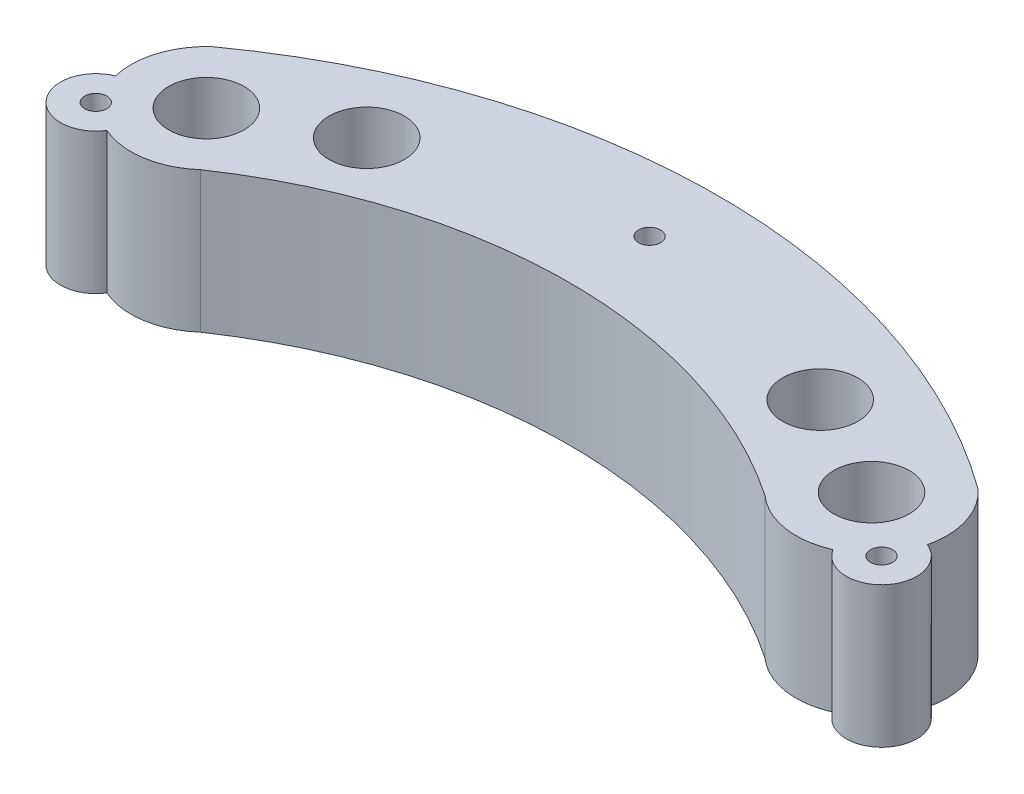
ISO-10303-21;
HEADER;
FILE_DESCRIPTION(('STEP AP214'),'2;1');
FILE_NAME('part.step','',(''),(''),'','','');
FILE_SCHEMA(('AUTOMOTIVE_DESIGN { 1 0 10303 214 1 1 1 1 }'));
ENDSEC;
DATA;
#1=APPLICATION_CONTEXT('core data for automotive mechanical design processes');
#2=APPLICATION_PROTOCOL_DEFINITION('international standard','automotive_design',2000,#1);
#3=PRODUCT_CONTEXT('',#1,'mechanical');
#4=PRODUCT('Part','Part','',(#3));
#5=PRODUCT_RELATED_PRODUCT_CATEGORY('part','',(#4));
#6=PRODUCT_DEFINITION_FORMATION('','',#4);
#7=PRODUCT_DEFINITION_CONTEXT('part definition',#1,'design');
#8=PRODUCT_DEFINITION('design','',#6,#7);
#9=PRODUCT_DEFINITION_SHAPE('','',#8);
#10=(LENGTH_UNIT() NAMED_UNIT(*) SI_UNIT(.MILLI.,.METRE.));
#11=(NAMED_UNIT(*) PLANE_ANGLE_UNIT() SI_UNIT($,.RADIAN.));
#12=(NAMED_UNIT(*) SI_UNIT($,.STERADIAN.) SOLID_ANGLE_UNIT());
#13=UNCERTAINTY_MEASURE_WITH_UNIT(LENGTH_MEASURE(1.E-05),#10,'distance_accuracy_value','');
#14=(GEOMETRIC_REPRESENTATION_CONTEXT(3) GLOBAL_UNCERTAINTY_ASSIGNED_CONTEXT((#13)) GLOBAL_UNIT_ASSIGNED_CONTEXT((#10,
#11,#12)) REPRESENTATION_CONTEXT('',''));
#15=CARTESIAN_POINT('',(0.,0.,0.));
#16=DIRECTION('',(0.,0.,1.));
#17=DIRECTION('',(1.,0.,0.));
#18=AXIS2_PLACEMENT_3D('',#15,#16,#17);
#19=CARTESIAN_POINT('',(84.0143896078789,-3.175,0.));
#20=DIRECTION('',(0.,1.,0.));
#21=DIRECTION('',(0.,0.,1.));
#22=AXIS2_PLACEMENT_3D('',#19,#20,#21);
#23=CYLINDRICAL_SURFACE('',#22,9.52500000000001);
#24=DIRECTION('',(0.,1.,0.));
#25=VECTOR('',#24,1.);
#26=CARTESIAN_POINT('',(93.2771410737958,5.715,2.21969824089963));
#27=LINE('',#26,#25);
#28=CARTESIAN_POINT('',(93.2771410737958,-3.175,2.21969824089963));
#29=VERTEX_POINT('',#28);
#30=CARTESIAN_POINT('',(93.2771410737958,14.605,2.21969824089963));
#31=VERTEX_POINT('',#30);
#32=EDGE_CURVE('E103',#29,#31,#27,.T.);
#33=ORIENTED_EDGE('',*,*,#32,.F.);
#34=CARTESIAN_POINT('',(84.0143896078789,-3.175,0.));
#35=DIRECTION('',(0.,1.,0.));
#36=DIRECTION('',(0.,0.,1.));
#37=AXIS2_PLACEMENT_3D('',#34,#35,#36);
#38=CIRCLE('',#37,9.52500000000001);
#39=CARTESIAN_POINT('',(90.364389607879,-3.175,-7.09951582856176));
#40=VERTEX_POINT('',#39);
#41=EDGE_CURVE('E113',#29,#40,#38,.T.);
#42=ORIENTED_EDGE('',*,*,#41,.T.);
#43=DIRECTION('',(0.,1.,0.));
#44=VECTOR('',#43,1.);
#45=CARTESIAN_POINT('',(90.364389607879,-3.175,-7.09951582856176));
#46=LINE('',#45,#44);
#47=CARTESIAN_POINT('',(90.364389607879,14.605,-7.09951582856176));
#48=VERTEX_POINT('',#47);
#49=EDGE_CURVE('E11',#40,#48,#46,.T.);
#50=ORIENTED_EDGE('',*,*,#49,.T.);
#51=CARTESIAN_POINT('',(84.0143896078789,14.605,0.));
#52=DIRECTION('',(0.,1.,0.));
#53=DIRECTION('',(0.,0.,1.));
#54=AXIS2_PLACEMENT_3D('',#51,#52,#53);
#55=CIRCLE('',#54,9.52500000000001);
#56=EDGE_CURVE('E115',#31,#48,#55,.T.);
#57=ORIENTED_EDGE('',*,*,#56,.F.);
#58=EDGE_LOOP('',(#33,#42,#50,#57));
#59=FACE_BOUND('',#58,.T.);
#60=ADVANCED_FACE('F35',(#59),#23,.T.);
#61=CARTESIAN_POINT('',(0.,-3.175,0.));
#62=DIRECTION('',(0.,1.,0.));
#63=DIRECTION('',(0.,0.,1.));
#64=AXIS2_PLACEMENT_3D('',#61,#62,#63);
#65=CYLINDRICAL_SURFACE('',#64,9.525);
#66=DIRECTION('',(0.,1.,0.));
#67=VECTOR('',#66,1.);
#68=CARTESIAN_POINT('',(-3.85364197670597,5.715,8.71062962795283));
#69=LINE('',#68,#67);
#70=CARTESIAN_POINT('',(-3.85364197670597,-3.175,8.71062962795283));
#71=VERTEX_POINT('',#70);
#72=CARTESIAN_POINT('',(-3.85364197670597,14.605,8.71062962795283));
#73=VERTEX_POINT('',#72);
#74=EDGE_CURVE('E195',#71,#73,#69,.T.);
#75=ORIENTED_EDGE('',*,*,#74,.F.);
#76=CARTESIAN_POINT('',(0.,-3.175,0.));
#77=DIRECTION('',(0.,1.,0.));
#78=DIRECTION('',(0.,0.,1.));
#79=AXIS2_PLACEMENT_3D('',#76,#77,#78);
#80=CIRCLE('',#79,9.525);
#81=CARTESIAN_POINT('',(6.35,-3.175,7.09951582856184));
#82=VERTEX_POINT('',#81);
#83=EDGE_CURVE('E184',#71,#82,#80,.T.);
#84=ORIENTED_EDGE('',*,*,#83,.T.);
#85=DIRECTION('',(0.,1.,0.));
#86=VECTOR('',#85,1.);
#87=CARTESIAN_POINT('',(6.35,-3.175,7.09951582856184));
#88=LINE('',#87,#86);
#89=CARTESIAN_POINT('',(6.35,14.605,7.09951582856184));
#90=VERTEX_POINT('',#89);
#91=EDGE_CURVE('E132',#82,#90,#88,.T.);
#92=ORIENTED_EDGE('',*,*,#91,.T.);
#93=CARTESIAN_POINT('',(0.,14.605,0.));
#94=DIRECTION('',(0.,1.,0.));
#95=DIRECTION('',(0.,0.,1.));
#96=AXIS2_PLACEMENT_3D('',#93,#94,#95);
#97=CIRCLE('',#96,9.525);
#98=EDGE_CURVE('E176',#73,#90,#97,.T.);
#99=ORIENTED_EDGE('',*,*,#98,.F.);
#100=EDGE_LOOP('',(#75,#84,#92,#99));
#101=FACE_BOUND('',#100,.T.);
#102=ADVANCED_FACE('F192',(#101),#65,.T.);
#103=CARTESIAN_POINT('',(42.0071948039394,-3.175,59.8040282531522));
#104=DIRECTION('',(0.,1.,0.));
#105=DIRECTION('',(0.,0.,1.));
#106=AXIS2_PLACEMENT_3D('',#103,#104,#105);
#107=CYLINDRICAL_SURFACE('',#106,82.55);
#108=DIRECTION('',(0.,1.,0.));
#109=VECTOR('',#108,1.);
#110=CARTESIAN_POINT('',(-6.35000000000005,-3.175,-7.09951582856179));
#111=LINE('',#110,#109);
#112=CARTESIAN_POINT('',(-6.35000000000005,-3.175,-7.09951582856179));
#113=VERTEX_POINT('',#112);
#114=CARTESIAN_POINT('',(-6.35000000000005,14.605,-7.09951582856179));
#115=VERTEX_POINT('',#114);
#116=EDGE_CURVE('E125',#113,#115,#111,.T.);
#117=ORIENTED_EDGE('',*,*,#116,.T.);
#118=CARTESIAN_POINT('',(42.0071948039394,14.605,59.8040282531522));
#119=DIRECTION('',(0.,1.,0.));
#120=DIRECTION('',(0.,0.,1.));
#121=AXIS2_PLACEMENT_3D('',#118,#119,#120);
#122=CIRCLE('',#121,82.55);
#123=EDGE_CURVE('E149',#115,#48,#122,.F.);
#124=ORIENTED_EDGE('',*,*,#123,.T.);
#125=ORIENTED_EDGE('',*,*,#49,.F.);
#126=CARTESIAN_POINT('',(42.0071948039394,-3.175,59.8040282531522));
#127=DIRECTION('',(0.,1.,0.));
#128=DIRECTION('',(0.,0.,1.));
#129=AXIS2_PLACEMENT_3D('',#126,#127,#128);
#130=CIRCLE('',#129,82.55);
#131=EDGE_CURVE('E120',#113,#40,#130,.F.);
#132=ORIENTED_EDGE('',*,*,#131,.F.);
#133=EDGE_LOOP('',(#117,#124,#125,#132));
#134=FACE_BOUND('',#133,.T.);
#135=ADVANCED_FACE('F37',(#134),#107,.T.);
#136=DIRECTION('',(0.,1.,0.));
#137=VECTOR('',#136,1.);
#138=CARTESIAN_POINT('',(87.8680315845849,5.715,8.71062962795284));
#139=LINE('',#138,#137);
#140=CARTESIAN_POINT('',(87.8680315845849,14.605,8.71062962795284));
#141=VERTEX_POINT('',#140);
#142=CARTESIAN_POINT('',(87.8680315845849,-3.175,8.71062962795284));
#143=VERTEX_POINT('',#142);
#144=EDGE_CURVE('E106',#141,#143,#139,.F.);
#145=ORIENTED_EDGE('',*,*,#144,.F.);
#146=CARTESIAN_POINT('',(77.6643896078788,14.605,7.09951582856182));
#147=VERTEX_POINT('',#146);
#148=EDGE_CURVE('E182',#147,#141,#55,.T.);
#149=ORIENTED_EDGE('',*,*,#148,.F.);
#150=DIRECTION('',(0.,1.,0.));
#151=VECTOR('',#150,1.);
#152=CARTESIAN_POINT('',(77.6643896078788,-3.175,7.09951582856182));
#153=LINE('',#152,#151);
#154=CARTESIAN_POINT('',(77.6643896078788,-3.175,7.09951582856182));
#155=VERTEX_POINT('',#154);
#156=EDGE_CURVE('E44',#155,#147,#153,.T.);
#157=ORIENTED_EDGE('',*,*,#156,.F.);
#158=EDGE_CURVE('E122',#155,#143,#38,.T.);
#159=ORIENTED_EDGE('',*,*,#158,.T.);
#160=EDGE_LOOP('',(#145,#149,#157,#159));
#161=FACE_BOUND('',#160,.T.);
#162=ADVANCED_FACE('F201',(#161),#23,.T.);
#163=CARTESIAN_POINT('',(42.0071948039394,-3.175,59.642968881382));
#164=DIRECTION('',(0.,1.,0.));
#165=DIRECTION('',(0.,0.,1.));
#166=AXIS2_PLACEMENT_3D('',#163,#164,#165);
#167=CYLINDRICAL_SURFACE('',#166,63.5);
#168=ORIENTED_EDGE('',*,*,#156,.T.);
#169=CARTESIAN_POINT('',(42.0071948039394,14.605,59.642968881382));
#170=DIRECTION('',(0.,1.,0.));
#171=DIRECTION('',(0.,0.,1.));
#172=AXIS2_PLACEMENT_3D('',#169,#170,#171);
#173=CIRCLE('',#172,63.5);
#174=EDGE_CURVE('E179',#90,#147,#173,.F.);
#175=ORIENTED_EDGE('',*,*,#174,.F.);
#176=ORIENTED_EDGE('',*,*,#91,.F.);
#177=CARTESIAN_POINT('',(42.0071948039394,-3.175,59.642968881382));
#178=DIRECTION('',(0.,1.,0.));
#179=DIRECTION('',(0.,0.,1.));
#180=AXIS2_PLACEMENT_3D('',#177,#178,#179);
#181=CIRCLE('',#180,63.5);
#182=EDGE_CURVE('E123',#82,#155,#181,.F.);
#183=ORIENTED_EDGE('',*,*,#182,.T.);
#184=EDGE_LOOP('',(#168,#175,#176,#183));
#185=FACE_BOUND('',#184,.T.);
#186=ADVANCED_FACE('F199',(#185),#167,.F.);
#187=DIRECTION('',(0.,1.,0.));
#188=VECTOR('',#187,1.);
#189=CARTESIAN_POINT('',(-9.26275146591698,5.715,2.21969824089963));
#190=LINE('',#189,#188);
#191=CARTESIAN_POINT('',(-9.26275146591698,14.605,2.21969824089963));
#192=VERTEX_POINT('',#191);
#193=CARTESIAN_POINT('',(-9.26275146591698,-3.175,2.21969824089963));
#194=VERTEX_POINT('',#193);
#195=EDGE_CURVE('E248',#192,#194,#190,.F.);
#196=ORIENTED_EDGE('',*,*,#195,.F.);
#197=EDGE_CURVE('E177',#115,#192,#97,.T.);
#198=ORIENTED_EDGE('',*,*,#197,.F.);
#199=ORIENTED_EDGE('',*,*,#116,.F.);
#200=EDGE_CURVE('E127',#113,#194,#80,.T.);
#201=ORIENTED_EDGE('',*,*,#200,.T.);
#202=EDGE_LOOP('',(#196,#198,#199,#201));
#203=FACE_BOUND('',#202,.T.);
#204=ADVANCED_FACE('F234',(#203),#65,.T.);
#205=CARTESIAN_POINT('',(0.,-3.175,0.));
#206=DIRECTION('',(0.,1.,0.));
#207=DIRECTION('',(0.,0.,1.));
#208=AXIS2_PLACEMENT_3D('',#205,#206,#207);
#209=PLANE('',#208);
#210=CARTESIAN_POINT('',(42.0071948039394,-3.175,-13.97));
#211=DIRECTION('',(0.,1.,0.));
#212=DIRECTION('',(0.,0.,1.));
#213=AXIS2_PLACEMENT_3D('',#210,#211,#212);
#214=CIRCLE('',#213,1.397);
#215=CARTESIAN_POINT('',(42.0071948039394,-3.175,-12.573));
#216=VERTEX_POINT('',#215);
#217=EDGE_CURVE('E502',#216,#216,#214,.T.);
#218=ORIENTED_EDGE('',*,*,#217,.T.);
#219=EDGE_LOOP('',(#218));
#220=FACE_BOUND('',#219,.T.);
#221=CARTESIAN_POINT('',(-7.62,-3.175,6.35));
#222=DIRECTION('',(0.,1.,0.));
#223=DIRECTION('',(0.,0.,1.));
#224=AXIS2_PLACEMENT_3D('',#221,#222,#223);
#225=CIRCLE('',#224,1.397);
#226=CARTESIAN_POINT('',(-7.62,-3.175,7.747));
#227=VERTEX_POINT('',#226);
#228=EDGE_CURVE('E506',#227,#227,#225,.T.);
#229=ORIENTED_EDGE('',*,*,#228,.T.);
#230=EDGE_LOOP('',(#229));
#231=FACE_BOUND('',#230,.T.);
#232=CARTESIAN_POINT('',(91.6343896078789,-3.175,6.35));
#233=DIRECTION('',(0.,1.,0.));
#234=DIRECTION('',(0.,0.,1.));
#235=AXIS2_PLACEMENT_3D('',#232,#233,#234);
#236=CIRCLE('',#235,1.39699999999999);
#237=CARTESIAN_POINT('',(91.6343896078789,-3.175,7.74699999999999));
#238=VERTEX_POINT('',#237);
#239=EDGE_CURVE('E515',#238,#238,#236,.T.);
#240=ORIENTED_EDGE('',*,*,#239,.T.);
#241=EDGE_LOOP('',(#240));
#242=FACE_BOUND('',#241,.T.);
#243=CARTESIAN_POINT('',(84.0143896078789,-3.175,0.));
#244=DIRECTION('',(0.,1.,0.));
#245=DIRECTION('',(0.,0.,1.));
#246=AXIS2_PLACEMENT_3D('',#243,#244,#245);
#247=CIRCLE('',#246,2.2225);
#248=CARTESIAN_POINT('',(84.0143896078789,-3.175,2.2225));
#249=VERTEX_POINT('',#248);
#250=EDGE_CURVE('E39',#249,#249,#247,.T.);
#251=ORIENTED_EDGE('',*,*,#250,.T.);
#252=EDGE_LOOP('',(#251));
#253=FACE_BOUND('',#252,.T.);
#254=CARTESIAN_POINT('',(70.6469868316689,-3.175,-6.88606544106099));
#255=DIRECTION('',(0.,1.,0.));
#256=DIRECTION('',(0.,0.,1.));
#257=AXIS2_PLACEMENT_3D('',#254,#255,#256);
#258=CIRCLE('',#257,2.2225);
#259=CARTESIAN_POINT('',(70.6469868316689,-3.175,-4.66356544106099));
#260=VERTEX_POINT('',#259);
#261=EDGE_CURVE('E156',#260,#260,#258,.T.);
#262=ORIENTED_EDGE('',*,*,#261,.T.);
#263=EDGE_LOOP('',(#262));
#264=FACE_BOUND('',#263,.T.);
#265=CARTESIAN_POINT('',(0.,-3.175,0.));
#266=DIRECTION('',(0.,1.,0.));
#267=DIRECTION('',(0.,0.,1.));
#268=AXIS2_PLACEMENT_3D('',#265,#266,#267);
#269=CIRCLE('',#268,2.2225);
#270=CARTESIAN_POINT('',(0.,-3.175,2.2225));
#271=VERTEX_POINT('',#270);
#272=EDGE_CURVE('E153',#271,#271,#269,.T.);
#273=ORIENTED_EDGE('',*,*,#272,.T.);
#274=EDGE_LOOP('',(#273));
#275=FACE_BOUND('',#274,.T.);
#276=CARTESIAN_POINT('',(13.36740277621,-3.175,-6.88606544106099));
#277=DIRECTION('',(0.,1.,0.));
#278=DIRECTION('',(0.,0.,1.));
#279=AXIS2_PLACEMENT_3D('',#276,#277,#278);
#280=CIRCLE('',#279,2.2225);
#281=CARTESIAN_POINT('',(13.36740277621,-3.175,-4.66356544106099));
#282=VERTEX_POINT('',#281);
#283=EDGE_CURVE('E150',#282,#282,#280,.T.);
#284=ORIENTED_EDGE('',*,*,#283,.T.);
#285=EDGE_LOOP('',(#284));
#286=FACE_BOUND('',#285,.T.);
#287=ORIENTED_EDGE('',*,*,#41,.F.);
#288=CARTESIAN_POINT('',(91.6343896078789,-3.175,6.35));
#289=DIRECTION('',(0.,1.,0.));
#290=DIRECTION('',(0.,0.,1.));
#291=AXIS2_PLACEMENT_3D('',#288,#289,#290);
#292=CIRCLE('',#291,4.445);
#293=EDGE_CURVE('E100',#143,#29,#292,.T.);
#294=ORIENTED_EDGE('',*,*,#293,.F.);
#295=ORIENTED_EDGE('',*,*,#158,.F.);
#296=ORIENTED_EDGE('',*,*,#182,.F.);
#297=ORIENTED_EDGE('',*,*,#83,.F.);
#298=CARTESIAN_POINT('',(-7.62,-3.175,6.35));
#299=DIRECTION('',(0.,1.,0.));
#300=DIRECTION('',(0.,0.,1.));
#301=AXIS2_PLACEMENT_3D('',#298,#299,#300);
#302=CIRCLE('',#301,4.445);
#303=EDGE_CURVE('E250',#194,#71,#302,.T.);
#304=ORIENTED_EDGE('',*,*,#303,.F.);
#305=ORIENTED_EDGE('',*,*,#200,.F.);
#306=ORIENTED_EDGE('',*,*,#131,.T.);
#307=EDGE_LOOP('',(#287,#294,#295,#296,#297,#304,#305,#306));
#308=FACE_BOUND('',#307,.T.);
#309=ADVANCED_FACE('F117',(#220,#231,#242,#253,#264,#275,#286,#308),#209,.F.);
#310=CARTESIAN_POINT('',(0.,14.605,0.));
#311=DIRECTION('',(0.,1.,0.));
#312=DIRECTION('',(0.,0.,1.));
#313=AXIS2_PLACEMENT_3D('',#310,#311,#312);
#314=PLANE('',#313);
#315=CARTESIAN_POINT('',(42.0071948039394,14.605,-13.97));
#316=DIRECTION('',(0.,1.,0.));
#317=DIRECTION('',(0.,0.,1.));
#318=AXIS2_PLACEMENT_3D('',#315,#316,#317);
#319=CIRCLE('',#318,1.397);
#320=CARTESIAN_POINT('',(42.0071948039394,14.605,-12.573));
#321=VERTEX_POINT('',#320);
#322=EDGE_CURVE('E505',#321,#321,#319,.T.);
#323=ORIENTED_EDGE('',*,*,#322,.F.);
#324=EDGE_LOOP('',(#323));
#325=FACE_BOUND('',#324,.T.);
#326=CARTESIAN_POINT('',(-7.62,14.605,6.35));
#327=DIRECTION('',(0.,1.,0.));
#328=DIRECTION('',(0.,0.,1.));
#329=AXIS2_PLACEMENT_3D('',#326,#327,#328);
#330=CIRCLE('',#329,1.397);
#331=CARTESIAN_POINT('',(-7.62,14.605,7.747));
#332=VERTEX_POINT('',#331);
#333=EDGE_CURVE('E510',#332,#332,#330,.T.);
#334=ORIENTED_EDGE('',*,*,#333,.F.);
#335=EDGE_LOOP('',(#334));
#336=FACE_BOUND('',#335,.T.);
#337=CARTESIAN_POINT('',(91.6343896078789,14.605,6.35));
#338=DIRECTION('',(0.,1.,0.));
#339=DIRECTION('',(0.,0.,1.));
#340=AXIS2_PLACEMENT_3D('',#337,#338,#339);
#341=CIRCLE('',#340,1.39699999999999);
#342=CARTESIAN_POINT('',(91.6343896078789,14.605,7.74699999999999));
#343=VERTEX_POINT('',#342);
#344=EDGE_CURVE('E518',#343,#343,#341,.T.);
#345=ORIENTED_EDGE('',*,*,#344,.F.);
#346=EDGE_LOOP('',(#345));
#347=FACE_BOUND('',#346,.T.);
#348=ORIENTED_EDGE('',*,*,#148,.T.);
#349=CARTESIAN_POINT('',(91.6343896078789,14.605,6.35));
#350=DIRECTION('',(0.,1.,0.));
#351=DIRECTION('',(0.,0.,1.));
#352=AXIS2_PLACEMENT_3D('',#349,#350,#351);
#353=CIRCLE('',#352,4.445);
#354=EDGE_CURVE('E52',#141,#31,#353,.T.);
#355=ORIENTED_EDGE('',*,*,#354,.T.);
#356=ORIENTED_EDGE('',*,*,#56,.T.);
#357=ORIENTED_EDGE('',*,*,#123,.F.);
#358=ORIENTED_EDGE('',*,*,#197,.T.);
#359=CARTESIAN_POINT('',(-7.62,14.605,6.35));
#360=DIRECTION('',(0.,1.,0.));
#361=DIRECTION('',(0.,0.,1.));
#362=AXIS2_PLACEMENT_3D('',#359,#360,#361);
#363=CIRCLE('',#362,4.445);
#364=EDGE_CURVE('E59',#192,#73,#363,.T.);
#365=ORIENTED_EDGE('',*,*,#364,.T.);
#366=ORIENTED_EDGE('',*,*,#98,.T.);
#367=ORIENTED_EDGE('',*,*,#174,.T.);
#368=EDGE_LOOP('',(#348,#355,#356,#357,#358,#365,#366,#367));
#369=FACE_BOUND('',#368,.T.);
#370=CARTESIAN_POINT('',(0.,14.605,0.));
#371=DIRECTION('',(0.,1.,0.));
#372=DIRECTION('',(0.,0.,1.));
#373=AXIS2_PLACEMENT_3D('',#370,#371,#372);
#374=CIRCLE('',#373,4.7625);
#375=CARTESIAN_POINT('',(0.,14.605,4.7625));
#376=VERTEX_POINT('',#375);
#377=EDGE_CURVE('E146',#376,#376,#374,.F.);
#378=ORIENTED_EDGE('',*,*,#377,.T.);
#379=EDGE_LOOP('',(#378));
#380=FACE_BOUND('',#379,.T.);
#381=CARTESIAN_POINT('',(13.36740277621,14.605,-6.88606544106099));
#382=DIRECTION('',(0.,1.,0.));
#383=DIRECTION('',(0.,0.,1.));
#384=AXIS2_PLACEMENT_3D('',#381,#382,#383);
#385=CIRCLE('',#384,4.7625);
#386=CARTESIAN_POINT('',(13.36740277621,14.605,-2.12356544106099));
#387=VERTEX_POINT('',#386);
#388=EDGE_CURVE('E143',#387,#387,#385,.F.);
#389=ORIENTED_EDGE('',*,*,#388,.T.);
#390=EDGE_LOOP('',(#389));
#391=FACE_BOUND('',#390,.T.);
#392=CARTESIAN_POINT('',(70.6469868316689,14.605,-6.88606544106099));
#393=DIRECTION('',(0.,1.,0.));
#394=DIRECTION('',(0.,0.,1.));
#395=AXIS2_PLACEMENT_3D('',#392,#393,#394);
#396=CIRCLE('',#395,4.7625);
#397=CARTESIAN_POINT('',(70.6469868316689,14.605,-2.12356544106099));
#398=VERTEX_POINT('',#397);
#399=EDGE_CURVE('E139',#398,#398,#396,.F.);
#400=ORIENTED_EDGE('',*,*,#399,.T.);
#401=EDGE_LOOP('',(#400));
#402=FACE_BOUND('',#401,.T.);
#403=CARTESIAN_POINT('',(84.0143896078789,14.605,0.));
#404=DIRECTION('',(0.,1.,0.));
#405=DIRECTION('',(0.,0.,1.));
#406=AXIS2_PLACEMENT_3D('',#403,#404,#405);
#407=CIRCLE('',#406,4.7625);
#408=CARTESIAN_POINT('',(84.0143896078789,14.605,4.7625));
#409=VERTEX_POINT('',#408);
#410=EDGE_CURVE('E136',#409,#409,#407,.F.);
#411=ORIENTED_EDGE('',*,*,#410,.T.);
#412=EDGE_LOOP('',(#411));
#413=FACE_BOUND('',#412,.T.);
#414=ADVANCED_FACE('F203',(#325,#336,#347,#369,#380,#391,#402,#413),#314,.T.);
#415=CARTESIAN_POINT('',(84.0143896078789,20.32,0.));
#416=DIRECTION('',(0.,-1.,0.));
#417=DIRECTION('',(0.,0.,-1.));
#418=AXIS2_PLACEMENT_3D('',#415,#416,#417);
#419=CYLINDRICAL_SURFACE('',#418,4.7625);
#420=ORIENTED_EDGE('',*,*,#410,.F.);
#421=EDGE_LOOP('',(#420));
#422=FACE_BOUND('',#421,.T.);
#423=CARTESIAN_POINT('',(84.0143896078789,0.,0.));
#424=DIRECTION('',(0.,1.,0.));
#425=DIRECTION('',(0.,0.,1.));
#426=AXIS2_PLACEMENT_3D('',#423,#424,#425);
#427=CIRCLE('',#426,4.7625);
#428=CARTESIAN_POINT('',(84.0143896078789,0.,4.7625));
#429=VERTEX_POINT('',#428);
#430=EDGE_CURVE('E161',#429,#429,#427,.T.);
#431=ORIENTED_EDGE('',*,*,#430,.F.);
#432=EDGE_LOOP('',(#431));
#433=FACE_BOUND('',#432,.T.);
#434=ADVANCED_FACE('F206',(#422,#433),#419,.F.);
#435=CARTESIAN_POINT('',(84.0143896078789,0.,0.));
#436=DIRECTION('',(0.,1.,0.));
#437=DIRECTION('',(0.,0.,1.));
#438=AXIS2_PLACEMENT_3D('',#435,#436,#437);
#439=PLANE('',#438);
#440=CARTESIAN_POINT('',(84.0143896078789,0.,0.));
#441=DIRECTION('',(0.,1.,0.));
#442=DIRECTION('',(0.,0.,1.));
#443=AXIS2_PLACEMENT_3D('',#440,#441,#442);
#444=CIRCLE('',#443,2.2225);
#445=CARTESIAN_POINT('',(84.0143896078789,0.,2.2225));
#446=VERTEX_POINT('',#445);
#447=EDGE_CURVE('E252',#446,#446,#444,.T.);
#448=ORIENTED_EDGE('',*,*,#447,.F.);
#449=EDGE_LOOP('',(#448));
#450=FACE_BOUND('',#449,.T.);
#451=ORIENTED_EDGE('',*,*,#430,.T.);
#452=EDGE_LOOP('',(#451));
#453=FACE_BOUND('',#452,.T.);
#454=ADVANCED_FACE('F219',(#450,#453),#439,.T.);
#455=CARTESIAN_POINT('',(70.6469868316689,20.32,-6.88606544106099));
#456=DIRECTION('',(0.,-1.,0.));
#457=DIRECTION('',(0.,0.,-1.));
#458=AXIS2_PLACEMENT_3D('',#455,#456,#457);
#459=CYLINDRICAL_SURFACE('',#458,4.7625);
#460=ORIENTED_EDGE('',*,*,#399,.F.);
#461=EDGE_LOOP('',(#460));
#462=FACE_BOUND('',#461,.T.);
#463=CARTESIAN_POINT('',(70.6469868316689,0.,-6.88606544106099));
#464=DIRECTION('',(0.,1.,0.));
#465=DIRECTION('',(0.,0.,1.));
#466=AXIS2_PLACEMENT_3D('',#463,#464,#465);
#467=CIRCLE('',#466,4.7625);
#468=CARTESIAN_POINT('',(70.6469868316689,0.,-2.12356544106099));
#469=VERTEX_POINT('',#468);
#470=EDGE_CURVE('E165',#469,#469,#467,.T.);
#471=ORIENTED_EDGE('',*,*,#470,.F.);
#472=EDGE_LOOP('',(#471));
#473=FACE_BOUND('',#472,.T.);
#474=ADVANCED_FACE('F225',(#462,#473),#459,.F.);
#475=CARTESIAN_POINT('',(70.6469868316689,0.,-6.88606544106099));
#476=DIRECTION('',(0.,1.,0.));
#477=DIRECTION('',(0.,0.,1.));
#478=AXIS2_PLACEMENT_3D('',#475,#476,#477);
#479=PLANE('',#478);
#480=CARTESIAN_POINT('',(70.6469868316689,0.,-6.88606544106099));
#481=DIRECTION('',(0.,1.,0.));
#482=DIRECTION('',(0.,0.,1.));
#483=AXIS2_PLACEMENT_3D('',#480,#481,#482);
#484=CIRCLE('',#483,2.2225);
#485=CARTESIAN_POINT('',(70.6469868316689,0.,-4.66356544106099));
#486=VERTEX_POINT('',#485);
#487=EDGE_CURVE('E260',#486,#486,#484,.T.);
#488=ORIENTED_EDGE('',*,*,#487,.F.);
#489=EDGE_LOOP('',(#488));
#490=FACE_BOUND('',#489,.T.);
#491=ORIENTED_EDGE('',*,*,#470,.T.);
#492=EDGE_LOOP('',(#491));
#493=FACE_BOUND('',#492,.T.);
#494=ADVANCED_FACE('F275',(#490,#493),#479,.T.);
#495=CARTESIAN_POINT('',(13.36740277621,20.32,-6.88606544106099));
#496=DIRECTION('',(0.,-1.,0.));
#497=DIRECTION('',(0.,0.,-1.));
#498=AXIS2_PLACEMENT_3D('',#495,#496,#497);
#499=CYLINDRICAL_SURFACE('',#498,4.7625);
#500=ORIENTED_EDGE('',*,*,#388,.F.);
#501=EDGE_LOOP('',(#500));
#502=FACE_BOUND('',#501,.T.);
#503=CARTESIAN_POINT('',(13.36740277621,0.,-6.88606544106099));
#504=DIRECTION('',(0.,1.,0.));
#505=DIRECTION('',(0.,0.,1.));
#506=AXIS2_PLACEMENT_3D('',#503,#504,#505);
#507=CIRCLE('',#506,4.7625);
#508=CARTESIAN_POINT('',(13.36740277621,0.,-2.12356544106099));
#509=VERTEX_POINT('',#508);
#510=EDGE_CURVE('E170',#509,#509,#507,.T.);
#511=ORIENTED_EDGE('',*,*,#510,.F.);
#512=EDGE_LOOP('',(#511));
#513=FACE_BOUND('',#512,.T.);
#514=ADVANCED_FACE('F273',(#502,#513),#499,.F.);
#515=CARTESIAN_POINT('',(13.36740277621,0.,-6.88606544106099));
#516=DIRECTION('',(0.,1.,0.));
#517=DIRECTION('',(0.,0.,1.));
#518=AXIS2_PLACEMENT_3D('',#515,#516,#517);
#519=PLANE('',#518);
#520=CARTESIAN_POINT('',(13.36740277621,0.,-6.88606544106099));
#521=DIRECTION('',(0.,1.,0.));
#522=DIRECTION('',(0.,0.,1.));
#523=AXIS2_PLACEMENT_3D('',#520,#521,#522);
#524=CIRCLE('',#523,2.2225);
#525=CARTESIAN_POINT('',(13.36740277621,0.,-4.66356544106099));
#526=VERTEX_POINT('',#525);
#527=EDGE_CURVE('E154',#526,#526,#524,.T.);
#528=ORIENTED_EDGE('',*,*,#527,.F.);
#529=EDGE_LOOP('',(#528));
#530=FACE_BOUND('',#529,.T.);
#531=ORIENTED_EDGE('',*,*,#510,.T.);
#532=EDGE_LOOP('',(#531));
#533=FACE_BOUND('',#532,.T.);
#534=ADVANCED_FACE('F271',(#530,#533),#519,.T.);
#535=CARTESIAN_POINT('',(0.,20.32,0.));
#536=DIRECTION('',(0.,-1.,0.));
#537=DIRECTION('',(0.,0.,-1.));
#538=AXIS2_PLACEMENT_3D('',#535,#536,#537);
#539=CYLINDRICAL_SURFACE('',#538,4.7625);
#540=ORIENTED_EDGE('',*,*,#377,.F.);
#541=EDGE_LOOP('',(#540));
#542=FACE_BOUND('',#541,.T.);
#543=CARTESIAN_POINT('',(0.,0.,0.));
#544=DIRECTION('',(0.,1.,0.));
#545=DIRECTION('',(0.,0.,1.));
#546=AXIS2_PLACEMENT_3D('',#543,#544,#545);
#547=CIRCLE('',#546,4.7625);
#548=CARTESIAN_POINT('',(0.,0.,4.7625));
#549=VERTEX_POINT('',#548);
#550=EDGE_CURVE('E140',#549,#549,#547,.T.);
#551=ORIENTED_EDGE('',*,*,#550,.F.);
#552=EDGE_LOOP('',(#551));
#553=FACE_BOUND('',#552,.T.);
#554=ADVANCED_FACE('F282',(#542,#553),#539,.F.);
#555=CARTESIAN_POINT('',(0.,0.,0.));
#556=DIRECTION('',(0.,1.,0.));
#557=DIRECTION('',(0.,0.,1.));
#558=AXIS2_PLACEMENT_3D('',#555,#556,#557);
#559=PLANE('',#558);
#560=CARTESIAN_POINT('',(0.,0.,0.));
#561=DIRECTION('',(0.,1.,0.));
#562=DIRECTION('',(0.,0.,1.));
#563=AXIS2_PLACEMENT_3D('',#560,#561,#562);
#564=CIRCLE('',#563,2.2225);
#565=CARTESIAN_POINT('',(0.,0.,2.2225));
#566=VERTEX_POINT('',#565);
#567=EDGE_CURVE('E257',#566,#566,#564,.T.);
#568=ORIENTED_EDGE('',*,*,#567,.F.);
#569=EDGE_LOOP('',(#568));
#570=FACE_BOUND('',#569,.T.);
#571=ORIENTED_EDGE('',*,*,#550,.T.);
#572=EDGE_LOOP('',(#571));
#573=FACE_BOUND('',#572,.T.);
#574=ADVANCED_FACE('F319',(#570,#573),#559,.T.);
#575=CARTESIAN_POINT('',(13.36740277621,-20.32,-6.88606544106099));
#576=DIRECTION('',(0.,1.,0.));
#577=DIRECTION('',(0.,0.,1.));
#578=AXIS2_PLACEMENT_3D('',#575,#576,#577);
#579=CYLINDRICAL_SURFACE('',#578,2.2225);
#580=ORIENTED_EDGE('',*,*,#527,.T.);
#581=EDGE_LOOP('',(#580));
#582=FACE_BOUND('',#581,.T.);
#583=ORIENTED_EDGE('',*,*,#283,.F.);
#584=EDGE_LOOP('',(#583));
#585=FACE_BOUND('',#584,.T.);
#586=ADVANCED_FACE('F324',(#582,#585),#579,.F.);
#587=CARTESIAN_POINT('',(0.,-20.32,0.));
#588=DIRECTION('',(0.,1.,0.));
#589=DIRECTION('',(0.,0.,1.));
#590=AXIS2_PLACEMENT_3D('',#587,#588,#589);
#591=CYLINDRICAL_SURFACE('',#590,2.2225);
#592=ORIENTED_EDGE('',*,*,#567,.T.);
#593=EDGE_LOOP('',(#592));
#594=FACE_BOUND('',#593,.T.);
#595=ORIENTED_EDGE('',*,*,#272,.F.);
#596=EDGE_LOOP('',(#595));
#597=FACE_BOUND('',#596,.T.);
#598=ADVANCED_FACE('F334',(#594,#597),#591,.F.);
#599=CARTESIAN_POINT('',(70.6469868316689,-20.32,-6.88606544106099));
#600=DIRECTION('',(0.,1.,0.));
#601=DIRECTION('',(0.,0.,1.));
#602=AXIS2_PLACEMENT_3D('',#599,#600,#601);
#603=CYLINDRICAL_SURFACE('',#602,2.2225);
#604=ORIENTED_EDGE('',*,*,#487,.T.);
#605=EDGE_LOOP('',(#604));
#606=FACE_BOUND('',#605,.T.);
#607=ORIENTED_EDGE('',*,*,#261,.F.);
#608=EDGE_LOOP('',(#607));
#609=FACE_BOUND('',#608,.T.);
#610=ADVANCED_FACE('F344',(#606,#609),#603,.F.);
#611=CARTESIAN_POINT('',(84.0143896078789,-20.32,0.));
#612=DIRECTION('',(0.,1.,0.));
#613=DIRECTION('',(0.,0.,1.));
#614=AXIS2_PLACEMENT_3D('',#611,#612,#613);
#615=CYLINDRICAL_SURFACE('',#614,2.2225);
#616=ORIENTED_EDGE('',*,*,#447,.T.);
#617=EDGE_LOOP('',(#616));
#618=FACE_BOUND('',#617,.T.);
#619=ORIENTED_EDGE('',*,*,#250,.F.);
#620=EDGE_LOOP('',(#619));
#621=FACE_BOUND('',#620,.T.);
#622=ADVANCED_FACE('F353',(#618,#621),#615,.F.);
#623=CARTESIAN_POINT('',(-7.62,-3.175,6.35));
#624=DIRECTION('',(0.,1.,0.));
#625=DIRECTION('',(0.,0.,1.));
#626=AXIS2_PLACEMENT_3D('',#623,#624,#625);
#627=CYLINDRICAL_SURFACE('',#626,4.445);
#628=ORIENTED_EDGE('',*,*,#303,.T.);
#629=ORIENTED_EDGE('',*,*,#74,.T.);
#630=ORIENTED_EDGE('',*,*,#364,.F.);
#631=ORIENTED_EDGE('',*,*,#195,.T.);
#632=EDGE_LOOP('',(#628,#629,#630,#631));
#633=FACE_BOUND('',#632,.T.);
#634=ADVANCED_FACE('F362',(#633),#627,.T.);
#635=CARTESIAN_POINT('',(91.6343896078789,-3.175,6.35));
#636=DIRECTION('',(0.,1.,0.));
#637=DIRECTION('',(0.,0.,1.));
#638=AXIS2_PLACEMENT_3D('',#635,#636,#637);
#639=CYLINDRICAL_SURFACE('',#638,4.445);
#640=ORIENTED_EDGE('',*,*,#293,.T.);
#641=ORIENTED_EDGE('',*,*,#32,.T.);
#642=ORIENTED_EDGE('',*,*,#354,.F.);
#643=ORIENTED_EDGE('',*,*,#144,.T.);
#644=EDGE_LOOP('',(#640,#641,#642,#643));
#645=FACE_BOUND('',#644,.T.);
#646=ADVANCED_FACE('F102',(#645),#639,.T.);
#647=CARTESIAN_POINT('',(91.6343896078789,-3.175,6.35));
#648=DIRECTION('',(0.,1.,0.));
#649=DIRECTION('',(0.,0.,1.));
#650=AXIS2_PLACEMENT_3D('',#647,#648,#649);
#651=CYLINDRICAL_SURFACE('',#650,1.39699999999999);
#652=ORIENTED_EDGE('',*,*,#239,.F.);
#653=EDGE_LOOP('',(#652));
#654=FACE_BOUND('',#653,.T.);
#655=ORIENTED_EDGE('',*,*,#344,.T.);
#656=EDGE_LOOP('',(#655));
#657=FACE_BOUND('',#656,.T.);
#658=ADVANCED_FACE('F399',(#654,#657),#651,.F.);
#659=CARTESIAN_POINT('',(-7.62,-3.175,6.35));
#660=DIRECTION('',(0.,1.,0.));
#661=DIRECTION('',(0.,0.,1.));
#662=AXIS2_PLACEMENT_3D('',#659,#660,#661);
#663=CYLINDRICAL_SURFACE('',#662,1.397);
#664=ORIENTED_EDGE('',*,*,#228,.F.);
#665=EDGE_LOOP('',(#664));
#666=FACE_BOUND('',#665,.T.);
#667=ORIENTED_EDGE('',*,*,#333,.T.);
#668=EDGE_LOOP('',(#667));
#669=FACE_BOUND('',#668,.T.);
#670=ADVANCED_FACE('F405',(#666,#669),#663,.F.);
#671=CARTESIAN_POINT('',(42.0071948039394,-3.175,-13.97));
#672=DIRECTION('',(0.,1.,0.));
#673=DIRECTION('',(0.,0.,1.));
#674=AXIS2_PLACEMENT_3D('',#671,#672,#673);
#675=CYLINDRICAL_SURFACE('',#674,1.397);
#676=ORIENTED_EDGE('',*,*,#217,.F.);
#677=EDGE_LOOP('',(#676));
#678=FACE_BOUND('',#677,.T.);
#679=ORIENTED_EDGE('',*,*,#322,.T.);
#680=EDGE_LOOP('',(#679));
#681=FACE_BOUND('',#680,.T.);
#682=ADVANCED_FACE('F413',(#678,#681),#675,.F.);
#683=CLOSED_SHELL('',(#60,#102,#135,#162,#186,#204,#309,#414,#434,#454,#474,#494,#514,#534,#554,
#574,#586,#598,#610,#622,#634,#646,#658,#670,#682));
#684=MANIFOLD_SOLID_BREP('B2',#683);
#685=ADVANCED_BREP_SHAPE_REPRESENTATION('',(#18,#684),#14);
#686=SHAPE_DEFINITION_REPRESENTATION(#9,#685);
ENDSEC;
END-ISO-10303-21;
